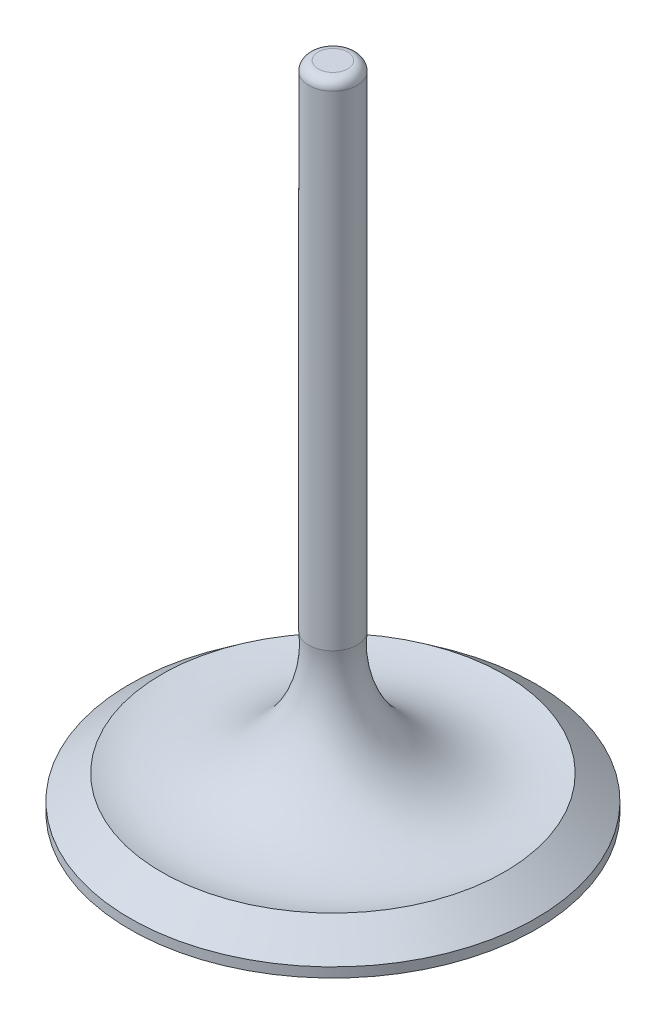
ISO-10303-21;
HEADER;
FILE_DESCRIPTION(('STEP AP214'),'2;1');
FILE_NAME('part.step','',(''),(''),'','','');
FILE_SCHEMA(('AUTOMOTIVE_DESIGN { 1 0 10303 214 1 1 1 1 }'));
ENDSEC;
DATA;
#1=APPLICATION_CONTEXT('core data for automotive mechanical design processes');
#2=APPLICATION_PROTOCOL_DEFINITION('international standard','automotive_design',2000,#1);
#3=PRODUCT_CONTEXT('',#1,'mechanical');
#4=PRODUCT('Part','Part','',(#3));
#5=PRODUCT_RELATED_PRODUCT_CATEGORY('part','',(#4));
#6=PRODUCT_DEFINITION_FORMATION('','',#4);
#7=PRODUCT_DEFINITION_CONTEXT('part definition',#1,'design');
#8=PRODUCT_DEFINITION('design','',#6,#7);
#9=PRODUCT_DEFINITION_SHAPE('','',#8);
#10=(LENGTH_UNIT() NAMED_UNIT(*) SI_UNIT(.MILLI.,.METRE.));
#11=(NAMED_UNIT(*) PLANE_ANGLE_UNIT() SI_UNIT($,.RADIAN.));
#12=(NAMED_UNIT(*) SI_UNIT($,.STERADIAN.) SOLID_ANGLE_UNIT());
#13=UNCERTAINTY_MEASURE_WITH_UNIT(LENGTH_MEASURE(1.E-05),#10,'distance_accuracy_value','');
#14=(GEOMETRIC_REPRESENTATION_CONTEXT(3) GLOBAL_UNCERTAINTY_ASSIGNED_CONTEXT((#13)) GLOBAL_UNIT_ASSIGNED_CONTEXT((#10,
#11,#12)) REPRESENTATION_CONTEXT('',''));
#15=CARTESIAN_POINT('',(0.,0.,0.));
#16=DIRECTION('',(0.,0.,1.));
#17=DIRECTION('',(1.,0.,0.));
#18=AXIS2_PLACEMENT_3D('',#15,#16,#17);
#19=CARTESIAN_POINT('',(0.,0.,0.));
#20=DIRECTION('',(0.,-1.,0.));
#21=DIRECTION('',(0.,0.,-1.));
#22=AXIS2_PLACEMENT_3D('',#19,#20,#21);
#23=PLANE('',#22);
#24=CARTESIAN_POINT('',(0.,0.,0.));
#25=DIRECTION('',(0.,-1.,0.));
#26=DIRECTION('',(0.,0.,-1.));
#27=AXIS2_PLACEMENT_3D('',#24,#25,#26);
#28=CIRCLE('',#27,26.67);
#29=CARTESIAN_POINT('',(0.,0.,-26.67));
#30=VERTEX_POINT('',#29);
#31=EDGE_CURVE('E50',#30,#30,#28,.T.);
#32=ORIENTED_EDGE('',*,*,#31,.T.);
#33=EDGE_LOOP('',(#32));
#34=FACE_BOUND('',#33,.T.);
#35=ADVANCED_FACE('F37',(#34),#23,.T.);
#36=CARTESIAN_POINT('',(0.,0.,0.));
#37=DIRECTION('',(0.,-1.,0.));
#38=DIRECTION('',(0.,0.,-1.));
#39=AXIS2_PLACEMENT_3D('',#36,#37,#38);
#40=CYLINDRICAL_SURFACE('',#39,26.67);
#41=CARTESIAN_POINT('',(0.,1.27,0.));
#42=DIRECTION('',(0.,-1.,0.));
#43=DIRECTION('',(0.,0.,-1.));
#44=AXIS2_PLACEMENT_3D('',#41,#42,#43);
#45=CIRCLE('',#44,26.67);
#46=CARTESIAN_POINT('',(0.,1.27,-26.67));
#47=VERTEX_POINT('',#46);
#48=EDGE_CURVE('E55',#47,#47,#45,.T.);
#49=ORIENTED_EDGE('',*,*,#48,.T.);
#50=EDGE_LOOP('',(#49));
#51=FACE_BOUND('',#50,.T.);
#52=ORIENTED_EDGE('',*,*,#31,.F.);
#53=EDGE_LOOP('',(#52));
#54=FACE_BOUND('',#53,.T.);
#55=ADVANCED_FACE('F85',(#51,#54),#40,.T.);
#56=CARTESIAN_POINT('',(0.,1.27,0.));
#57=DIRECTION('',(0.,-1.,0.));
#58=DIRECTION('',(0.,0.,-1.));
#59=AXIS2_PLACEMENT_3D('',#56,#57,#58);
#60=CONICAL_SURFACE('',#59,26.67,0.918141589270101);
#61=CARTESIAN_POINT('',(0.,4.45,0.));
#62=DIRECTION('',(0.,-1.,0.));
#63=DIRECTION('',(0.,0.,-1.));
#64=AXIS2_PLACEMENT_3D('',#61,#62,#63);
#65=CIRCLE('',#64,22.5098843098622);
#66=CARTESIAN_POINT('',(0.,4.45,-22.5098843098622));
#67=VERTEX_POINT('',#66);
#68=EDGE_CURVE('E61',#67,#67,#65,.T.);
#69=ORIENTED_EDGE('',*,*,#68,.T.);
#70=EDGE_LOOP('',(#69));
#71=FACE_BOUND('',#70,.T.);
#72=ORIENTED_EDGE('',*,*,#48,.F.);
#73=EDGE_LOOP('',(#72));
#74=FACE_BOUND('',#73,.T.);
#75=ADVANCED_FACE('F82',(#71,#74),#60,.T.);
#76=CARTESIAN_POINT('',(0.,19.1233838675824,0.));
#77=DIRECTION('',(0.,-1.,0.));
#78=DIRECTION('',(0.,0.,-1.));
#79=AXIS2_PLACEMENT_3D('',#76,#77,#78);
#80=TOROIDAL_SURFACE('',#79,18.3560540443635,15.25);
#81=CARTESIAN_POINT('',(0.,20.6233450812668,0.));
#82=DIRECTION('',(0.,-1.,0.));
#83=DIRECTION('',(0.,0.,-1.));
#84=AXIS2_PLACEMENT_3D('',#81,#82,#83);
#85=CIRCLE('',#84,3.18);
#86=CARTESIAN_POINT('',(0.,20.6233450812668,-3.18));
#87=VERTEX_POINT('',#86);
#88=EDGE_CURVE('E65',#87,#87,#85,.T.);
#89=ORIENTED_EDGE('',*,*,#88,.T.);
#90=EDGE_LOOP('',(#89));
#91=FACE_BOUND('',#90,.T.);
#92=ORIENTED_EDGE('',*,*,#68,.F.);
#93=EDGE_LOOP('',(#92));
#94=FACE_BOUND('',#93,.T.);
#95=ADVANCED_FACE('F70',(#91,#94),#80,.F.);
#96=CARTESIAN_POINT('',(0.,0.,0.));
#97=DIRECTION('',(0.,-1.,0.));
#98=DIRECTION('',(0.,0.,-1.));
#99=AXIS2_PLACEMENT_3D('',#96,#97,#98);
#100=CYLINDRICAL_SURFACE('',#99,3.18);
#101=CARTESIAN_POINT('',(0.,84.3,0.));
#102=DIRECTION('',(0.,1.,0.));
#103=DIRECTION('',(0.,0.,1.));
#104=AXIS2_PLACEMENT_3D('',#101,#102,#103);
#105=CIRCLE('',#104,3.18);
#106=CARTESIAN_POINT('',(0.,84.3,3.18));
#107=VERTEX_POINT('',#106);
#108=EDGE_CURVE('E45',#107,#107,#105,.F.);
#109=ORIENTED_EDGE('',*,*,#108,.T.);
#110=EDGE_LOOP('',(#109));
#111=FACE_BOUND('',#110,.T.);
#112=ORIENTED_EDGE('',*,*,#88,.F.);
#113=EDGE_LOOP('',(#112));
#114=FACE_BOUND('',#113,.T.);
#115=ADVANCED_FACE('F73',(#111,#114),#100,.T.);
#116=CARTESIAN_POINT('',(0.,85.55,0.));
#117=DIRECTION('',(0.,1.,0.));
#118=DIRECTION('',(0.,0.,1.));
#119=AXIS2_PLACEMENT_3D('',#116,#117,#118);
#120=PLANE('',#119);
#121=CARTESIAN_POINT('',(0.,85.55,0.));
#122=DIRECTION('',(0.,1.,0.));
#123=DIRECTION('',(0.,0.,1.));
#124=AXIS2_PLACEMENT_3D('',#121,#122,#123);
#125=CIRCLE('',#124,1.93);
#126=CARTESIAN_POINT('',(0.,85.55,1.93));
#127=VERTEX_POINT('',#126);
#128=EDGE_CURVE('E10',#127,#127,#125,.T.);
#129=ORIENTED_EDGE('',*,*,#128,.T.);
#130=EDGE_LOOP('',(#129));
#131=FACE_BOUND('',#130,.T.);
#132=ADVANCED_FACE('F75',(#131),#120,.T.);
#133=CARTESIAN_POINT('',(0.,84.3,0.));
#134=DIRECTION('',(0.,1.,0.));
#135=DIRECTION('',(0.,0.,1.));
#136=AXIS2_PLACEMENT_3D('',#133,#134,#135);
#137=TOROIDAL_SURFACE('',#136,1.93,1.25);
#138=ORIENTED_EDGE('',*,*,#128,.F.);
#139=EDGE_LOOP('',(#138));
#140=FACE_BOUND('',#139,.T.);
#141=ORIENTED_EDGE('',*,*,#108,.F.);
#142=EDGE_LOOP('',(#141));
#143=FACE_BOUND('',#142,.T.);
#144=ADVANCED_FACE('F39',(#140,#143),#137,.T.);
#145=CLOSED_SHELL('',(#35,#55,#75,#95,#115,#132,#144));
#146=MANIFOLD_SOLID_BREP('B2',#145);
#147=ADVANCED_BREP_SHAPE_REPRESENTATION('',(#18,#146),#14);
#148=SHAPE_DEFINITION_REPRESENTATION(#9,#147);
ENDSEC;
END-ISO-10303-21;
